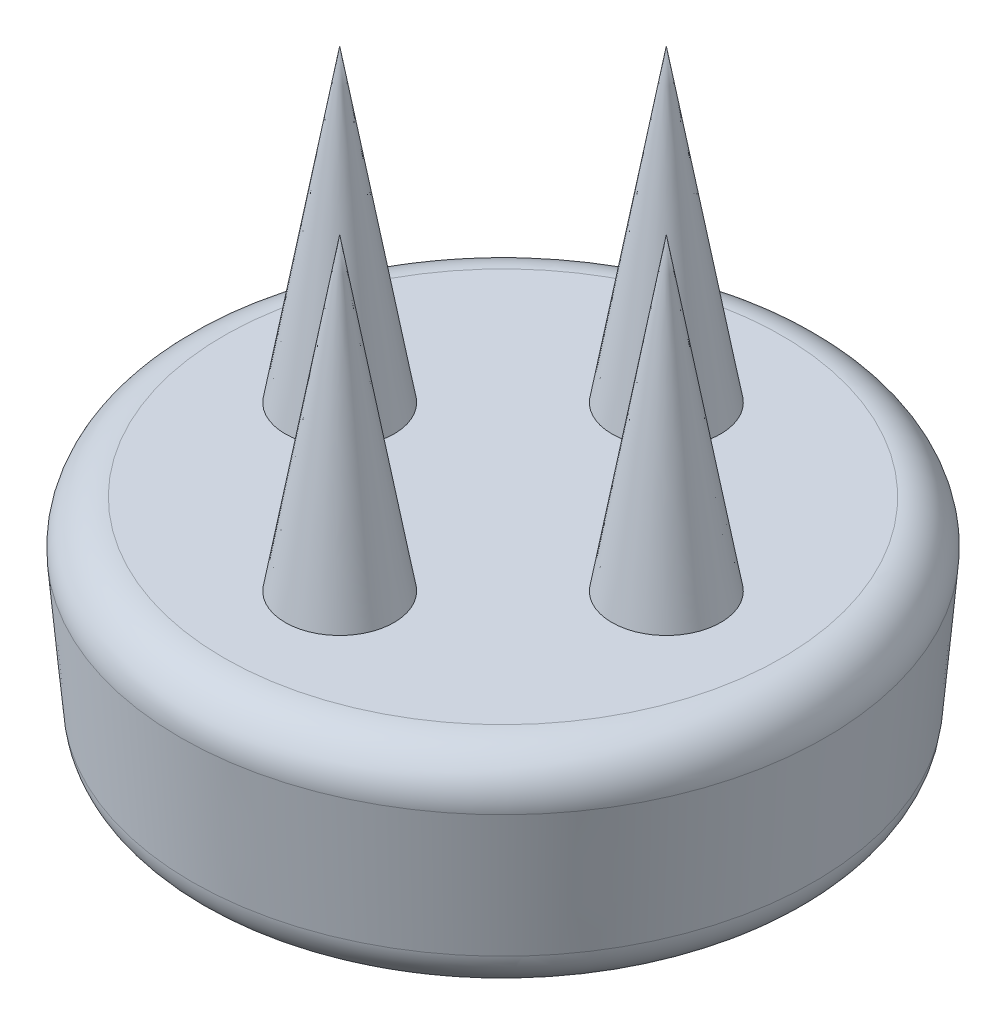
ISO-10303-21;
HEADER;
FILE_DESCRIPTION(('STEP AP214'),'2;1');
FILE_NAME('part.step','',(''),(''),'','','');
FILE_SCHEMA(('AUTOMOTIVE_DESIGN { 1 0 10303 214 1 1 1 1 }'));
ENDSEC;
DATA;
#1=APPLICATION_CONTEXT('core data for automotive mechanical design processes');
#2=APPLICATION_PROTOCOL_DEFINITION('international standard','automotive_design',2000,#1);
#3=PRODUCT_CONTEXT('',#1,'mechanical');
#4=PRODUCT('Part','Part','',(#3));
#5=PRODUCT_RELATED_PRODUCT_CATEGORY('part','',(#4));
#6=PRODUCT_DEFINITION_FORMATION('','',#4);
#7=PRODUCT_DEFINITION_CONTEXT('part definition',#1,'design');
#8=PRODUCT_DEFINITION('design','',#6,#7);
#9=PRODUCT_DEFINITION_SHAPE('','',#8);
#10=(LENGTH_UNIT() NAMED_UNIT(*) SI_UNIT(.MILLI.,.METRE.));
#11=(NAMED_UNIT(*) PLANE_ANGLE_UNIT() SI_UNIT($,.RADIAN.));
#12=(NAMED_UNIT(*) SI_UNIT($,.STERADIAN.) SOLID_ANGLE_UNIT());
#13=UNCERTAINTY_MEASURE_WITH_UNIT(LENGTH_MEASURE(1.E-05),#10,'distance_accuracy_value','');
#14=(GEOMETRIC_REPRESENTATION_CONTEXT(3) GLOBAL_UNCERTAINTY_ASSIGNED_CONTEXT((#13)) GLOBAL_UNIT_ASSIGNED_CONTEXT((#10,
#11,#12)) REPRESENTATION_CONTEXT('',''));
#15=CARTESIAN_POINT('',(0.,0.,0.));
#16=DIRECTION('',(0.,0.,1.));
#17=DIRECTION('',(1.,0.,0.));
#18=AXIS2_PLACEMENT_3D('',#15,#16,#17);
#19=CARTESIAN_POINT('',(0.,0.,0.));
#20=DIRECTION('',(0.,1.,0.));
#21=DIRECTION('',(0.,0.,1.));
#22=AXIS2_PLACEMENT_3D('',#19,#20,#21);
#23=CONICAL_SURFACE('',#22,15.,0.0872664625997167);
#24=CARTESIAN_POINT('',(0.,-2.17431148549532,0.));
#25=DIRECTION('',(0.,-1.,0.));
#26=DIRECTION('',(0.,0.,-1.));
#27=AXIS2_PLACEMENT_3D('',#24,#25,#26);
#28=CIRCLE('',#27,14.8097723940449);
#29=CARTESIAN_POINT('',(0.,-2.17431148549532,-14.8097723940449));
#30=VERTEX_POINT('',#29);
#31=EDGE_CURVE('E44',#30,#30,#28,.T.);
#32=ORIENTED_EDGE('',*,*,#31,.T.);
#33=EDGE_LOOP('',(#32));
#34=FACE_BOUND('',#33,.T.);
#35=CARTESIAN_POINT('',(0.,-8.17431148549532,0.));
#36=DIRECTION('',(0.,1.,0.));
#37=DIRECTION('',(0.,0.,1.));
#38=AXIS2_PLACEMENT_3D('',#35,#36,#37);
#39=CIRCLE('',#38,14.2848404128894);
#40=CARTESIAN_POINT('',(0.,-8.17431148549532,14.2848404128894));
#41=VERTEX_POINT('',#40);
#42=EDGE_CURVE('E86',#41,#41,#39,.T.);
#43=ORIENTED_EDGE('',*,*,#42,.T.);
#44=EDGE_LOOP('',(#43));
#45=FACE_BOUND('',#44,.T.);
#46=ADVANCED_FACE('F36',(#34,#45),#23,.T.);
#47=CARTESIAN_POINT('',(0.,-10.,0.));
#48=DIRECTION('',(0.,1.,0.));
#49=DIRECTION('',(0.,0.,1.));
#50=AXIS2_PLACEMENT_3D('',#47,#48,#49);
#51=PLANE('',#50);
#52=CARTESIAN_POINT('',(0.,-10.,0.));
#53=DIRECTION('',(0.,1.,0.));
#54=DIRECTION('',(0.,0.,1.));
#55=AXIS2_PLACEMENT_3D('',#52,#53,#54);
#56=CIRCLE('',#55,12.2924510167059);
#57=CARTESIAN_POINT('',(0.,-10.,12.2924510167059));
#58=VERTEX_POINT('',#57);
#59=EDGE_CURVE('E11',#58,#58,#56,.F.);
#60=ORIENTED_EDGE('',*,*,#59,.T.);
#61=EDGE_LOOP('',(#60));
#62=FACE_BOUND('',#61,.T.);
#63=CARTESIAN_POINT('',(0.,-10.,0.));
#64=DIRECTION('',(0.,-1.,0.));
#65=DIRECTION('',(0.,0.,-1.));
#66=AXIS2_PLACEMENT_3D('',#63,#64,#65);
#67=CIRCLE('',#66,5.);
#68=CARTESIAN_POINT('',(0.,-10.,-5.));
#69=VERTEX_POINT('',#68);
#70=EDGE_CURVE('E74',#69,#69,#67,.T.);
#71=ORIENTED_EDGE('',*,*,#70,.F.);
#72=EDGE_LOOP('',(#71));
#73=FACE_BOUND('',#72,.T.);
#74=ADVANCED_FACE('F102',(#62,#73),#51,.F.);
#75=CARTESIAN_POINT('',(0.,0.,0.));
#76=DIRECTION('',(0.,1.,0.));
#77=DIRECTION('',(0.,0.,1.));
#78=AXIS2_PLACEMENT_3D('',#75,#76,#77);
#79=PLANE('',#78);
#80=CARTESIAN_POINT('',(0.,0.,0.));
#81=DIRECTION('',(0.,1.,0.));
#82=DIRECTION('',(0.,0.,1.));
#83=AXIS2_PLACEMENT_3D('',#80,#81,#82);
#84=CIRCLE('',#83,12.8173829978615);
#85=CARTESIAN_POINT('',(0.,0.,12.8173829978615));
#86=VERTEX_POINT('',#85);
#87=EDGE_CURVE('E83',#86,#86,#84,.T.);
#88=ORIENTED_EDGE('',*,*,#87,.T.);
#89=EDGE_LOOP('',(#88));
#90=FACE_BOUND('',#89,.T.);
#91=CARTESIAN_POINT('',(-7.49999999999952,0.,4.78789710048643E-13));
#92=DIRECTION('',(0.,1.,0.));
#93=DIRECTION('',(0.,0.,1.));
#94=AXIS2_PLACEMENT_3D('',#91,#92,#93);
#95=CIRCLE('',#94,2.5);
#96=CARTESIAN_POINT('',(-7.49999999999952,0.,2.50000000000048));
#97=VERTEX_POINT('',#96);
#98=EDGE_CURVE('E65',#97,#97,#95,.T.);
#99=ORIENTED_EDGE('',*,*,#98,.F.);
#100=EDGE_LOOP('',(#99));
#101=FACE_BOUND('',#100,.T.);
#102=CARTESIAN_POINT('',(9.55742449898565E-13,0.,7.5));
#103=DIRECTION('',(0.,1.,0.));
#104=DIRECTION('',(0.,0.,1.));
#105=AXIS2_PLACEMENT_3D('',#102,#103,#104);
#106=CIRCLE('',#105,2.50000000000003);
#107=CARTESIAN_POINT('',(9.55742449898565E-13,0.,10.));
#108=VERTEX_POINT('',#107);
#109=EDGE_CURVE('E67',#108,#108,#106,.T.);
#110=ORIENTED_EDGE('',*,*,#109,.F.);
#111=EDGE_LOOP('',(#110));
#112=FACE_BOUND('',#111,.T.);
#113=CARTESIAN_POINT('',(7.50000000000048,0.,-4.77871224949283E-13));
#114=DIRECTION('',(0.,1.,0.));
#115=DIRECTION('',(0.,0.,1.));
#116=AXIS2_PLACEMENT_3D('',#113,#114,#115);
#117=CIRCLE('',#116,2.5);
#118=CARTESIAN_POINT('',(7.50000000000048,0.,2.49999999999952));
#119=VERTEX_POINT('',#118);
#120=EDGE_CURVE('E71',#119,#119,#117,.T.);
#121=ORIENTED_EDGE('',*,*,#120,.F.);
#122=EDGE_LOOP('',(#121));
#123=FACE_BOUND('',#122,.T.);
#124=CARTESIAN_POINT('',(0.,0.,-7.5));
#125=DIRECTION('',(0.,1.,0.));
#126=DIRECTION('',(0.,0.,1.));
#127=AXIS2_PLACEMENT_3D('',#124,#125,#126);
#128=CIRCLE('',#127,2.5);
#129=CARTESIAN_POINT('',(0.,0.,-5.));
#130=VERTEX_POINT('',#129);
#131=EDGE_CURVE('E80',#130,#130,#128,.T.);
#132=ORIENTED_EDGE('',*,*,#131,.F.);
#133=EDGE_LOOP('',(#132));
#134=FACE_BOUND('',#133,.T.);
#135=ADVANCED_FACE('F99',(#90,#101,#112,#123,#134),#79,.T.);
#136=CARTESIAN_POINT('',(0.,0.,-7.5));
#137=DIRECTION('',(0.,-1.,0.));
#138=DIRECTION('',(0.,0.,1.));
#139=AXIS2_PLACEMENT_3D('',#136,#137,#138);
#140=CONICAL_SURFACE('',#139,2.5,0.174532925199433);
#141=CARTESIAN_POINT('',(0.,14.1782045490443,-7.5));
#142=VERTEX_POINT('',#141);
#143=VERTEX_LOOP('',#142);
#144=FACE_BOUND('',#143,.T.);
#145=ORIENTED_EDGE('',*,*,#131,.T.);
#146=EDGE_LOOP('',(#145));
#147=FACE_BOUND('',#146,.T.);
#148=ADVANCED_FACE('F101',(#144,#147),#140,.T.);
#149=CARTESIAN_POINT('',(7.50000000000048,0.,-4.77871224949283E-13));
#150=DIRECTION('',(0.,-1.,0.));
#151=DIRECTION('',(0.,0.,1.));
#152=AXIS2_PLACEMENT_3D('',#149,#150,#151);
#153=CONICAL_SURFACE('',#152,2.5,0.174532925199433);
#154=CARTESIAN_POINT('',(7.50000000000048,14.1782045490443,-4.77871224949283E-13));
#155=VERTEX_POINT('',#154);
#156=VERTEX_LOOP('',#155);
#157=FACE_BOUND('',#156,.T.);
#158=ORIENTED_EDGE('',*,*,#120,.T.);
#159=EDGE_LOOP('',(#158));
#160=FACE_BOUND('',#159,.T.);
#161=ADVANCED_FACE('F112',(#157,#160),#153,.T.);
#162=CARTESIAN_POINT('',(9.55742449898565E-13,0.,7.5));
#163=DIRECTION('',(0.,-1.,0.));
#164=DIRECTION('',(0.,0.,1.));
#165=AXIS2_PLACEMENT_3D('',#162,#163,#164);
#166=CONICAL_SURFACE('',#165,2.50000000000003,0.174532925199433);
#167=CARTESIAN_POINT('',(9.55742449898565E-13,14.1782045490445,7.5));
#168=VERTEX_POINT('',#167);
#169=VERTEX_LOOP('',#168);
#170=FACE_BOUND('',#169,.T.);
#171=ORIENTED_EDGE('',*,*,#109,.T.);
#172=EDGE_LOOP('',(#171));
#173=FACE_BOUND('',#172,.T.);
#174=ADVANCED_FACE('F61',(#170,#173),#166,.T.);
#175=CARTESIAN_POINT('',(-7.49999999999952,0.,4.78789710048643E-13));
#176=DIRECTION('',(0.,-1.,0.));
#177=DIRECTION('',(0.,0.,1.));
#178=AXIS2_PLACEMENT_3D('',#175,#176,#177);
#179=CONICAL_SURFACE('',#178,2.5,0.174532925199433);
#180=CARTESIAN_POINT('',(-7.49999999999952,14.1782045490443,4.78789710048643E-13));
#181=VERTEX_POINT('',#180);
#182=VERTEX_LOOP('',#181);
#183=FACE_BOUND('',#182,.T.);
#184=ORIENTED_EDGE('',*,*,#98,.T.);
#185=EDGE_LOOP('',(#184));
#186=FACE_BOUND('',#185,.T.);
#187=ADVANCED_FACE('F57',(#183,#186),#179,.T.);
#188=CARTESIAN_POINT('',(0.,-5.,0.));
#189=DIRECTION('',(0.,-1.,0.));
#190=DIRECTION('',(0.,0.,-1.));
#191=AXIS2_PLACEMENT_3D('',#188,#189,#190);
#192=CYLINDRICAL_SURFACE('',#191,5.);
#193=CARTESIAN_POINT('',(0.,-5.,0.));
#194=DIRECTION('',(0.,-1.,0.));
#195=DIRECTION('',(0.,0.,-1.));
#196=AXIS2_PLACEMENT_3D('',#193,#194,#195);
#197=CIRCLE('',#196,5.);
#198=CARTESIAN_POINT('',(0.,-5.,-5.));
#199=VERTEX_POINT('',#198);
#200=EDGE_CURVE('E68',#199,#199,#197,.T.);
#201=ORIENTED_EDGE('',*,*,#200,.F.);
#202=EDGE_LOOP('',(#201));
#203=FACE_BOUND('',#202,.T.);
#204=ORIENTED_EDGE('',*,*,#70,.T.);
#205=EDGE_LOOP('',(#204));
#206=FACE_BOUND('',#205,.T.);
#207=ADVANCED_FACE('F60',(#203,#206),#192,.F.);
#208=CARTESIAN_POINT('',(0.,-5.,0.));
#209=DIRECTION('',(0.,-1.,0.));
#210=DIRECTION('',(0.,0.,-1.));
#211=AXIS2_PLACEMENT_3D('',#208,#209,#210);
#212=PLANE('',#211);
#213=ORIENTED_EDGE('',*,*,#200,.T.);
#214=EDGE_LOOP('',(#213));
#215=FACE_BOUND('',#214,.T.);
#216=ADVANCED_FACE('F96',(#215),#212,.T.);
#217=CARTESIAN_POINT('',(0.,-2.,0.));
#218=DIRECTION('',(0.,1.,0.));
#219=DIRECTION('',(0.,0.,1.));
#220=AXIS2_PLACEMENT_3D('',#217,#218,#219);
#221=TOROIDAL_SURFACE('',#220,12.8173829978615,2.);
#222=ORIENTED_EDGE('',*,*,#31,.F.);
#223=EDGE_LOOP('',(#222));
#224=FACE_BOUND('',#223,.T.);
#225=ORIENTED_EDGE('',*,*,#87,.F.);
#226=EDGE_LOOP('',(#225));
#227=FACE_BOUND('',#226,.T.);
#228=ADVANCED_FACE('F93',(#224,#227),#221,.T.);
#229=CARTESIAN_POINT('',(0.,-8.,0.));
#230=DIRECTION('',(0.,1.,0.));
#231=DIRECTION('',(0.,0.,1.));
#232=AXIS2_PLACEMENT_3D('',#229,#230,#231);
#233=TOROIDAL_SURFACE('',#232,12.2924510167059,2.);
#234=ORIENTED_EDGE('',*,*,#59,.F.);
#235=EDGE_LOOP('',(#234));
#236=FACE_BOUND('',#235,.T.);
#237=ORIENTED_EDGE('',*,*,#42,.F.);
#238=EDGE_LOOP('',(#237));
#239=FACE_BOUND('',#238,.T.);
#240=ADVANCED_FACE('F38',(#236,#239),#233,.T.);
#241=CLOSED_SHELL('',(#46,#74,#135,#148,#161,#174,#187,#207,#216,#228,#240));
#242=MANIFOLD_SOLID_BREP('B2',#241);
#243=ADVANCED_BREP_SHAPE_REPRESENTATION('',(#18,#242),#14);
#244=SHAPE_DEFINITION_REPRESENTATION(#9,#243);
ENDSEC;
END-ISO-10303-21;
